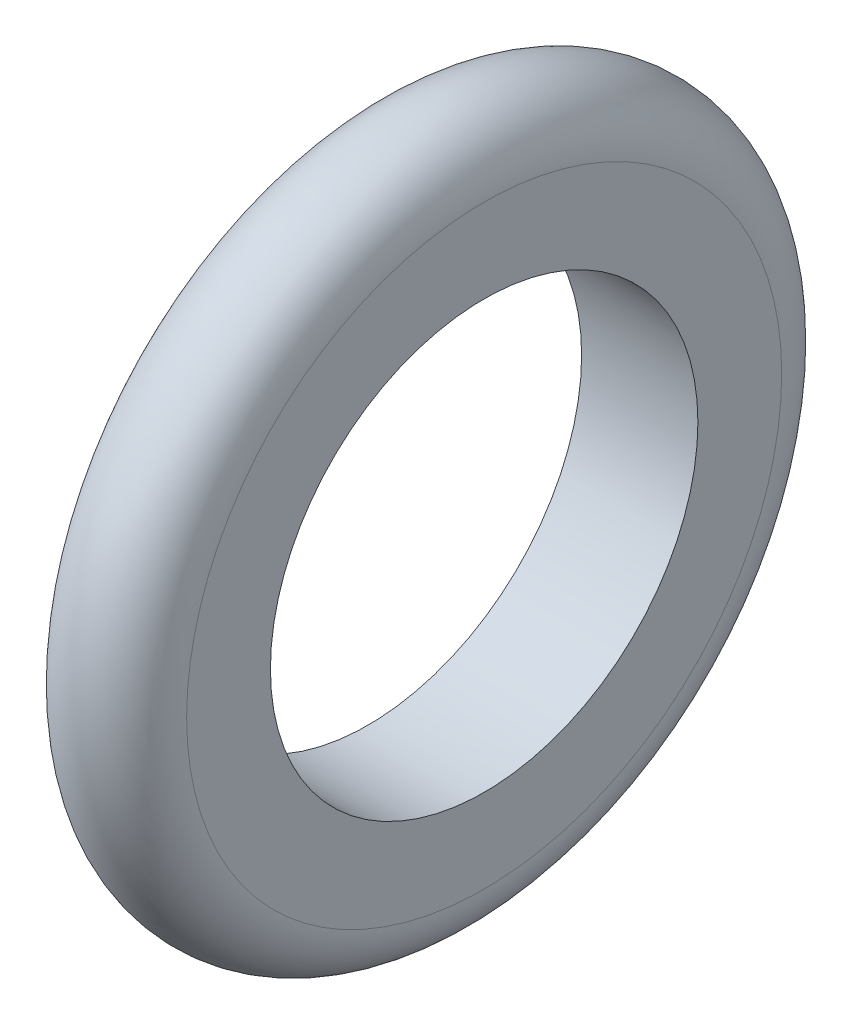
ISO-10303-21;
HEADER;
FILE_DESCRIPTION(('STEP AP214'),'2;1');
FILE_NAME('part.step','',(''),(''),'','','');
FILE_SCHEMA(('AUTOMOTIVE_DESIGN { 1 0 10303 214 1 1 1 1 }'));
ENDSEC;
DATA;
#1=APPLICATION_CONTEXT('core data for automotive mechanical design processes');
#2=APPLICATION_PROTOCOL_DEFINITION('international standard','automotive_design',2000,#1);
#3=PRODUCT_CONTEXT('',#1,'mechanical');
#4=PRODUCT('Part','Part','',(#3));
#5=PRODUCT_RELATED_PRODUCT_CATEGORY('part','',(#4));
#6=PRODUCT_DEFINITION_FORMATION('','',#4);
#7=PRODUCT_DEFINITION_CONTEXT('part definition',#1,'design');
#8=PRODUCT_DEFINITION('design','',#6,#7);
#9=PRODUCT_DEFINITION_SHAPE('','',#8);
#10=(LENGTH_UNIT() NAMED_UNIT(*) SI_UNIT(.MILLI.,.METRE.));
#11=(NAMED_UNIT(*) PLANE_ANGLE_UNIT() SI_UNIT($,.RADIAN.));
#12=(NAMED_UNIT(*) SI_UNIT($,.STERADIAN.) SOLID_ANGLE_UNIT());
#13=UNCERTAINTY_MEASURE_WITH_UNIT(LENGTH_MEASURE(1.E-05),#10,'distance_accuracy_value','');
#14=(GEOMETRIC_REPRESENTATION_CONTEXT(3) GLOBAL_UNCERTAINTY_ASSIGNED_CONTEXT((#13)) GLOBAL_UNIT_ASSIGNED_CONTEXT((#10,
#11,#12)) REPRESENTATION_CONTEXT('',''));
#15=CARTESIAN_POINT('',(0.,0.,0.));
#16=DIRECTION('',(0.,0.,1.));
#17=DIRECTION('',(1.,0.,0.));
#18=AXIS2_PLACEMENT_3D('',#15,#16,#17);
#19=CARTESIAN_POINT('',(1.0795,0.,0.));
#20=DIRECTION('',(1.,0.,0.));
#21=DIRECTION('',(0.,0.,-1.));
#22=AXIS2_PLACEMENT_3D('',#19,#20,#21);
#23=TOROIDAL_SURFACE('',#22,5.5245,1.0795);
#24=CARTESIAN_POINT('',(0.,0.,0.));
#25=DIRECTION('',(1.,0.,0.));
#26=DIRECTION('',(0.,0.,-1.));
#27=AXIS2_PLACEMENT_3D('',#24,#25,#26);
#28=CIRCLE('',#27,5.5245);
#29=CARTESIAN_POINT('',(0.,0.,-5.5245));
#30=VERTEX_POINT('',#29);
#31=EDGE_CURVE('E40',#30,#30,#28,.F.);
#32=ORIENTED_EDGE('',*,*,#31,.F.);
#33=EDGE_LOOP('',(#32));
#34=FACE_BOUND('',#33,.T.);
#35=CARTESIAN_POINT('',(2.159,0.,0.));
#36=DIRECTION('',(1.,0.,0.));
#37=DIRECTION('',(0.,0.,-1.));
#38=AXIS2_PLACEMENT_3D('',#35,#36,#37);
#39=CIRCLE('',#38,5.5245);
#40=CARTESIAN_POINT('',(2.159,0.,-5.5245));
#41=VERTEX_POINT('',#40);
#42=EDGE_CURVE('E10',#41,#41,#39,.T.);
#43=ORIENTED_EDGE('',*,*,#42,.F.);
#44=EDGE_LOOP('',(#43));
#45=FACE_BOUND('',#44,.T.);
#46=ADVANCED_FACE('F33',(#34,#45),#23,.T.);
#47=CARTESIAN_POINT('',(2.159,0.,0.));
#48=DIRECTION('',(1.,0.,0.));
#49=DIRECTION('',(0.,0.,-1.));
#50=AXIS2_PLACEMENT_3D('',#47,#48,#49);
#51=PLANE('',#50);
#52=ORIENTED_EDGE('',*,*,#42,.T.);
#53=EDGE_LOOP('',(#52));
#54=FACE_BOUND('',#53,.T.);
#55=CARTESIAN_POINT('',(2.159,0.,0.));
#56=DIRECTION('',(1.,0.,0.));
#57=DIRECTION('',(0.,0.,-1.));
#58=AXIS2_PLACEMENT_3D('',#55,#56,#57);
#59=CIRCLE('',#58,3.96875);
#60=CARTESIAN_POINT('',(2.159,0.,-3.96875));
#61=VERTEX_POINT('',#60);
#62=EDGE_CURVE('E44',#61,#61,#59,.T.);
#63=ORIENTED_EDGE('',*,*,#62,.F.);
#64=EDGE_LOOP('',(#63));
#65=FACE_BOUND('',#64,.T.);
#66=ADVANCED_FACE('F63',(#54,#65),#51,.T.);
#67=CARTESIAN_POINT('',(0.,0.,0.));
#68=DIRECTION('',(1.,0.,0.));
#69=DIRECTION('',(0.,0.,-1.));
#70=AXIS2_PLACEMENT_3D('',#67,#68,#69);
#71=PLANE('',#70);
#72=ORIENTED_EDGE('',*,*,#31,.T.);
#73=EDGE_LOOP('',(#72));
#74=FACE_BOUND('',#73,.T.);
#75=CARTESIAN_POINT('',(0.,0.,0.));
#76=DIRECTION('',(1.,0.,0.));
#77=DIRECTION('',(0.,0.,-1.));
#78=AXIS2_PLACEMENT_3D('',#75,#76,#77);
#79=CIRCLE('',#78,3.96875);
#80=CARTESIAN_POINT('',(0.,0.,-3.96875));
#81=VERTEX_POINT('',#80);
#82=EDGE_CURVE('E48',#81,#81,#79,.T.);
#83=ORIENTED_EDGE('',*,*,#82,.T.);
#84=EDGE_LOOP('',(#83));
#85=FACE_BOUND('',#84,.T.);
#86=ADVANCED_FACE('F54',(#74,#85),#71,.F.);
#87=CARTESIAN_POINT('',(2.159,0.,0.));
#88=DIRECTION('',(-1.,0.,0.));
#89=DIRECTION('',(0.,0.,1.));
#90=AXIS2_PLACEMENT_3D('',#87,#88,#89);
#91=CYLINDRICAL_SURFACE('',#90,3.96875);
#92=ORIENTED_EDGE('',*,*,#62,.T.);
#93=EDGE_LOOP('',(#92));
#94=FACE_BOUND('',#93,.T.);
#95=ORIENTED_EDGE('',*,*,#82,.F.);
#96=EDGE_LOOP('',(#95));
#97=FACE_BOUND('',#96,.T.);
#98=ADVANCED_FACE('F56',(#94,#97),#91,.F.);
#99=CLOSED_SHELL('',(#46,#66,#86,#98));
#100=MANIFOLD_SOLID_BREP('B2',#99);
#101=ADVANCED_BREP_SHAPE_REPRESENTATION('',(#18,#100),#14);
#102=SHAPE_DEFINITION_REPRESENTATION(#9,#101);
ENDSEC;
END-ISO-10303-21;
